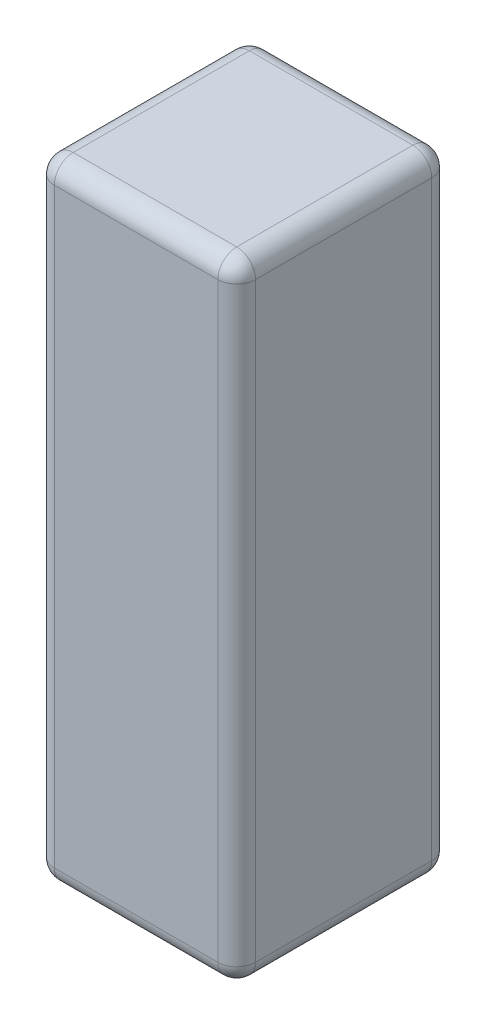
ISO-10303-21;
HEADER;
FILE_DESCRIPTION(('STEP AP214'),'2;1');
FILE_NAME('part.step','',(''),(''),'','','');
FILE_SCHEMA(('AUTOMOTIVE_DESIGN { 1 0 10303 214 1 1 1 1 }'));
ENDSEC;
DATA;
#1=APPLICATION_CONTEXT('core data for automotive mechanical design processes');
#2=APPLICATION_PROTOCOL_DEFINITION('international standard','automotive_design',2000,#1);
#3=PRODUCT_CONTEXT('',#1,'mechanical');
#4=PRODUCT('Part','Part','',(#3));
#5=PRODUCT_RELATED_PRODUCT_CATEGORY('part','',(#4));
#6=PRODUCT_DEFINITION_FORMATION('','',#4);
#7=PRODUCT_DEFINITION_CONTEXT('part definition',#1,'design');
#8=PRODUCT_DEFINITION('design','',#6,#7);
#9=PRODUCT_DEFINITION_SHAPE('','',#8);
#10=(LENGTH_UNIT() NAMED_UNIT(*) SI_UNIT(.MILLI.,.METRE.));
#11=(NAMED_UNIT(*) PLANE_ANGLE_UNIT() SI_UNIT($,.RADIAN.));
#12=(NAMED_UNIT(*) SI_UNIT($,.STERADIAN.) SOLID_ANGLE_UNIT());
#13=UNCERTAINTY_MEASURE_WITH_UNIT(LENGTH_MEASURE(1.E-05),#10,'distance_accuracy_value','');
#14=(GEOMETRIC_REPRESENTATION_CONTEXT(3) GLOBAL_UNCERTAINTY_ASSIGNED_CONTEXT((#13)) GLOBAL_UNIT_ASSIGNED_CONTEXT((#10,
#11,#12)) REPRESENTATION_CONTEXT('',''));
#15=CARTESIAN_POINT('',(0.,0.,0.));
#16=DIRECTION('',(0.,0.,1.));
#17=DIRECTION('',(1.,0.,0.));
#18=AXIS2_PLACEMENT_3D('',#15,#16,#17);
#19=CARTESIAN_POINT('',(30.3060427220879,2.65057988159413,34.));
#20=DIRECTION('',(1.,0.,0.));
#21=DIRECTION('',(0.,1.,0.));
#22=AXIS2_PLACEMENT_3D('',#19,#20,#21);
#23=PLANE('',#22);
#24=DIRECTION('',(0.,-1.,0.));
#25=VECTOR('',#24,1.);
#26=CARTESIAN_POINT('',(30.3060427220879,2.65057988159413,31.));
#27=LINE('',#26,#25);
#28=CARTESIAN_POINT('',(30.3060427220879,-94.3494201184059,31.));
#29=VERTEX_POINT('',#28);
#30=CARTESIAN_POINT('',(30.3060427220879,-0.349420118405869,31.));
#31=VERTEX_POINT('',#30);
#32=EDGE_CURVE('E174',#29,#31,#27,.F.);
#33=ORIENTED_EDGE('',*,*,#32,.T.);
#34=DIRECTION('',(0.,0.,-1.));
#35=VECTOR('',#34,1.);
#36=CARTESIAN_POINT('',(30.3060427220879,-0.349420118405869,34.));
#37=LINE('',#36,#35);
#38=CARTESIAN_POINT('',(30.3060427220879,-0.349420118405869,3.));
#39=VERTEX_POINT('',#38);
#40=EDGE_CURVE('E179',#31,#39,#37,.T.);
#41=ORIENTED_EDGE('',*,*,#40,.T.);
#42=DIRECTION('',(0.,-1.,0.));
#43=VECTOR('',#42,1.);
#44=CARTESIAN_POINT('',(30.3060427220879,2.65057988159413,3.));
#45=LINE('',#44,#43);
#46=CARTESIAN_POINT('',(30.3060427220879,-94.3494201184059,3.));
#47=VERTEX_POINT('',#46);
#48=EDGE_CURVE('E176',#39,#47,#45,.T.);
#49=ORIENTED_EDGE('',*,*,#48,.T.);
#50=DIRECTION('',(0.,0.,-1.));
#51=VECTOR('',#50,1.);
#52=CARTESIAN_POINT('',(30.3060427220879,-94.3494201184059,34.));
#53=LINE('',#52,#51);
#54=EDGE_CURVE('E172',#47,#29,#53,.F.);
#55=ORIENTED_EDGE('',*,*,#54,.T.);
#56=EDGE_LOOP('',(#33,#41,#49,#55));
#57=FACE_BOUND('',#56,.T.);
#58=ADVANCED_FACE('F32',(#57),#23,.F.);
#59=CARTESIAN_POINT('',(30.3060427220879,-97.3494201184059,34.));
#60=DIRECTION('',(0.,1.,0.));
#61=DIRECTION('',(0.,0.,1.));
#62=AXIS2_PLACEMENT_3D('',#59,#60,#61);
#63=PLANE('',#62);
#64=DIRECTION('',(1.,0.,0.));
#65=VECTOR('',#64,1.);
#66=CARTESIAN_POINT('',(30.3060427220879,-97.3494201184059,31.));
#67=LINE('',#66,#65);
#68=CARTESIAN_POINT('',(59.3060427220879,-97.3494201184059,31.));
#69=VERTEX_POINT('',#68);
#70=CARTESIAN_POINT('',(33.3060427220879,-97.3494201184059,31.));
#71=VERTEX_POINT('',#70);
#72=EDGE_CURVE('E41',#69,#71,#67,.F.);
#73=ORIENTED_EDGE('',*,*,#72,.T.);
#74=DIRECTION('',(0.,0.,-1.));
#75=VECTOR('',#74,1.);
#76=CARTESIAN_POINT('',(33.3060427220879,-97.3494201184059,34.));
#77=LINE('',#76,#75);
#78=CARTESIAN_POINT('',(33.3060427220879,-97.3494201184059,3.));
#79=VERTEX_POINT('',#78);
#80=EDGE_CURVE('E11',#71,#79,#77,.T.);
#81=ORIENTED_EDGE('',*,*,#80,.T.);
#82=DIRECTION('',(1.,0.,0.));
#83=VECTOR('',#82,1.);
#84=CARTESIAN_POINT('',(30.3060427220879,-97.3494201184059,3.));
#85=LINE('',#84,#83);
#86=CARTESIAN_POINT('',(59.3060427220879,-97.3494201184059,3.));
#87=VERTEX_POINT('',#86);
#88=EDGE_CURVE('E197',#79,#87,#85,.T.);
#89=ORIENTED_EDGE('',*,*,#88,.T.);
#90=DIRECTION('',(0.,0.,-1.));
#91=VECTOR('',#90,1.);
#92=CARTESIAN_POINT('',(59.3060427220879,-97.3494201184059,34.));
#93=LINE('',#92,#91);
#94=EDGE_CURVE('E52',#87,#69,#93,.F.);
#95=ORIENTED_EDGE('',*,*,#94,.T.);
#96=EDGE_LOOP('',(#73,#81,#89,#95));
#97=FACE_BOUND('',#96,.T.);
#98=ADVANCED_FACE('F306',(#97),#63,.F.);
#99=CARTESIAN_POINT('',(62.3060427220879,2.65057988159413,34.));
#100=DIRECTION('',(-1.,0.,0.));
#101=DIRECTION('',(0.,-1.,0.));
#102=AXIS2_PLACEMENT_3D('',#99,#100,#101);
#103=PLANE('',#102);
#104=DIRECTION('',(0.,1.,0.));
#105=VECTOR('',#104,1.);
#106=CARTESIAN_POINT('',(62.3060427220879,2.65057988159413,3.));
#107=LINE('',#106,#105);
#108=CARTESIAN_POINT('',(62.3060427220879,-94.3494201184059,3.));
#109=VERTEX_POINT('',#108);
#110=CARTESIAN_POINT('',(62.3060427220879,-0.349420118405868,3.));
#111=VERTEX_POINT('',#110);
#112=EDGE_CURVE('E131',#109,#111,#107,.T.);
#113=ORIENTED_EDGE('',*,*,#112,.T.);
#114=DIRECTION('',(0.,0.,-1.));
#115=VECTOR('',#114,1.);
#116=CARTESIAN_POINT('',(62.3060427220879,-0.349420118405868,34.));
#117=LINE('',#116,#115);
#118=CARTESIAN_POINT('',(62.3060427220879,-0.349420118405868,31.));
#119=VERTEX_POINT('',#118);
#120=EDGE_CURVE('E127',#111,#119,#117,.F.);
#121=ORIENTED_EDGE('',*,*,#120,.T.);
#122=DIRECTION('',(0.,1.,0.));
#123=VECTOR('',#122,1.);
#124=CARTESIAN_POINT('',(62.3060427220879,-97.3494201184059,31.));
#125=LINE('',#124,#123);
#126=CARTESIAN_POINT('',(62.3060427220879,-94.3494201184059,31.));
#127=VERTEX_POINT('',#126);
#128=EDGE_CURVE('E119',#119,#127,#125,.F.);
#129=ORIENTED_EDGE('',*,*,#128,.T.);
#130=DIRECTION('',(0.,0.,-1.));
#131=VECTOR('',#130,1.);
#132=CARTESIAN_POINT('',(62.3060427220879,-94.3494201184059,34.));
#133=LINE('',#132,#131);
#134=EDGE_CURVE('E124',#127,#109,#133,.T.);
#135=ORIENTED_EDGE('',*,*,#134,.T.);
#136=EDGE_LOOP('',(#113,#121,#129,#135));
#137=FACE_BOUND('',#136,.T.);
#138=ADVANCED_FACE('F122',(#137),#103,.F.);
#139=CARTESIAN_POINT('',(30.3060427220879,2.65057988159413,34.));
#140=DIRECTION('',(0.,-1.,0.));
#141=DIRECTION('',(0.,0.,-1.));
#142=AXIS2_PLACEMENT_3D('',#139,#140,#141);
#143=PLANE('',#142);
#144=DIRECTION('',(-1.,0.,0.));
#145=VECTOR('',#144,1.);
#146=CARTESIAN_POINT('',(62.3060427220879,2.65057988159413,31.));
#147=LINE('',#146,#145);
#148=CARTESIAN_POINT('',(33.3060427220879,2.65057988159413,31.));
#149=VERTEX_POINT('',#148);
#150=CARTESIAN_POINT('',(59.3060427220879,2.65057988159413,31.));
#151=VERTEX_POINT('',#150);
#152=EDGE_CURVE('E192',#149,#151,#147,.F.);
#153=ORIENTED_EDGE('',*,*,#152,.T.);
#154=DIRECTION('',(0.,0.,-1.));
#155=VECTOR('',#154,1.);
#156=CARTESIAN_POINT('',(59.3060427220879,2.65057988159413,34.));
#157=LINE('',#156,#155);
#158=CARTESIAN_POINT('',(59.3060427220879,2.65057988159413,3.));
#159=VERTEX_POINT('',#158);
#160=EDGE_CURVE('E194',#151,#159,#157,.T.);
#161=ORIENTED_EDGE('',*,*,#160,.T.);
#162=DIRECTION('',(-1.,0.,0.));
#163=VECTOR('',#162,1.);
#164=CARTESIAN_POINT('',(30.3060427220879,2.65057988159413,3.));
#165=LINE('',#164,#163);
#166=CARTESIAN_POINT('',(33.3060427220879,2.65057988159413,3.));
#167=VERTEX_POINT('',#166);
#168=EDGE_CURVE('E188',#159,#167,#165,.T.);
#169=ORIENTED_EDGE('',*,*,#168,.T.);
#170=DIRECTION('',(0.,0.,-1.));
#171=VECTOR('',#170,1.);
#172=CARTESIAN_POINT('',(33.3060427220879,2.65057988159413,34.));
#173=LINE('',#172,#171);
#174=EDGE_CURVE('E190',#167,#149,#173,.F.);
#175=ORIENTED_EDGE('',*,*,#174,.T.);
#176=EDGE_LOOP('',(#153,#161,#169,#175));
#177=FACE_BOUND('',#176,.T.);
#178=ADVANCED_FACE('F263',(#177),#143,.F.);
#179=CARTESIAN_POINT('',(0.,0.,34.));
#180=DIRECTION('',(0.,0.,1.));
#181=DIRECTION('',(1.,0.,0.));
#182=AXIS2_PLACEMENT_3D('',#179,#180,#181);
#183=PLANE('',#182);
#184=DIRECTION('',(0.,1.,0.));
#185=VECTOR('',#184,1.);
#186=CARTESIAN_POINT('',(59.3060427220879,2.65057988159413,34.));
#187=LINE('',#186,#185);
#188=CARTESIAN_POINT('',(59.3060427220879,-94.3494201184059,34.));
#189=VERTEX_POINT('',#188);
#190=CARTESIAN_POINT('',(59.3060427220879,-0.349420118405869,34.));
#191=VERTEX_POINT('',#190);
#192=EDGE_CURVE('E139',#189,#191,#187,.T.);
#193=ORIENTED_EDGE('',*,*,#192,.T.);
#194=DIRECTION('',(-1.,0.,0.));
#195=VECTOR('',#194,1.);
#196=CARTESIAN_POINT('',(30.3060427220879,-0.349420118405869,34.));
#197=LINE('',#196,#195);
#198=CARTESIAN_POINT('',(33.3060427220879,-0.349420118405869,34.));
#199=VERTEX_POINT('',#198);
#200=EDGE_CURVE('E186',#191,#199,#197,.T.);
#201=ORIENTED_EDGE('',*,*,#200,.T.);
#202=DIRECTION('',(0.,-1.,0.));
#203=VECTOR('',#202,1.);
#204=CARTESIAN_POINT('',(33.3060427220879,-97.3494201184059,34.));
#205=LINE('',#204,#203);
#206=CARTESIAN_POINT('',(33.3060427220879,-94.3494201184059,34.));
#207=VERTEX_POINT('',#206);
#208=EDGE_CURVE('E183',#199,#207,#205,.T.);
#209=ORIENTED_EDGE('',*,*,#208,.T.);
#210=DIRECTION('',(1.,0.,0.));
#211=VECTOR('',#210,1.);
#212=CARTESIAN_POINT('',(62.3060427220879,-94.3494201184059,34.));
#213=LINE('',#212,#211);
#214=EDGE_CURVE('E181',#207,#189,#213,.T.);
#215=ORIENTED_EDGE('',*,*,#214,.T.);
#216=EDGE_LOOP('',(#193,#201,#209,#215));
#217=FACE_BOUND('',#216,.T.);
#218=ADVANCED_FACE('F294',(#217),#183,.T.);
#219=CARTESIAN_POINT('',(0.,0.,0.));
#220=DIRECTION('',(0.,0.,1.));
#221=DIRECTION('',(1.,0.,0.));
#222=AXIS2_PLACEMENT_3D('',#219,#220,#221);
#223=PLANE('',#222);
#224=DIRECTION('',(0.,-1.,0.));
#225=VECTOR('',#224,1.);
#226=CARTESIAN_POINT('',(33.3060427220879,0.,0.));
#227=LINE('',#226,#225);
#228=CARTESIAN_POINT('',(33.3060427220879,-94.3494201184059,0.));
#229=VERTEX_POINT('',#228);
#230=CARTESIAN_POINT('',(33.3060427220879,-0.349420118405869,0.));
#231=VERTEX_POINT('',#230);
#232=EDGE_CURVE('E165',#229,#231,#227,.F.);
#233=ORIENTED_EDGE('',*,*,#232,.T.);
#234=DIRECTION('',(-1.,0.,0.));
#235=VECTOR('',#234,1.);
#236=CARTESIAN_POINT('',(0.,-0.349420118405869,0.));
#237=LINE('',#236,#235);
#238=CARTESIAN_POINT('',(59.3060427220879,-0.349420118405869,0.));
#239=VERTEX_POINT('',#238);
#240=EDGE_CURVE('E170',#231,#239,#237,.F.);
#241=ORIENTED_EDGE('',*,*,#240,.T.);
#242=DIRECTION('',(0.,1.,0.));
#243=VECTOR('',#242,1.);
#244=CARTESIAN_POINT('',(59.3060427220879,0.,0.));
#245=LINE('',#244,#243);
#246=CARTESIAN_POINT('',(59.3060427220879,-94.3494201184059,0.));
#247=VERTEX_POINT('',#246);
#248=EDGE_CURVE('E167',#239,#247,#245,.F.);
#249=ORIENTED_EDGE('',*,*,#248,.T.);
#250=DIRECTION('',(1.,0.,0.));
#251=VECTOR('',#250,1.);
#252=CARTESIAN_POINT('',(0.,-94.3494201184059,0.));
#253=LINE('',#252,#251);
#254=EDGE_CURVE('E163',#247,#229,#253,.F.);
#255=ORIENTED_EDGE('',*,*,#254,.T.);
#256=EDGE_LOOP('',(#233,#241,#249,#255));
#257=FACE_BOUND('',#256,.T.);
#258=ADVANCED_FACE('F296',(#257),#223,.F.);
#259=CARTESIAN_POINT('',(33.3060427220879,0.,31.));
#260=DIRECTION('',(0.,1.,0.));
#261=DIRECTION('',(-1.,0.,0.));
#262=AXIS2_PLACEMENT_3D('',#259,#260,#261);
#263=CYLINDRICAL_SURFACE('',#262,3.);
#264=CARTESIAN_POINT('',(33.3060427220879,-94.3494201184059,31.));
#265=DIRECTION('',(0.,-1.,0.));
#266=DIRECTION('',(0.,0.,-1.));
#267=AXIS2_PLACEMENT_3D('',#264,#265,#266);
#268=CIRCLE('',#267,3.);
#269=EDGE_CURVE('E36',#207,#29,#268,.T.);
#270=ORIENTED_EDGE('',*,*,#269,.F.);
#271=ORIENTED_EDGE('',*,*,#208,.F.);
#272=CARTESIAN_POINT('',(33.3060427220879,-0.349420118405869,31.));
#273=DIRECTION('',(0.,1.,0.));
#274=DIRECTION('',(-1.,0.,0.));
#275=AXIS2_PLACEMENT_3D('',#272,#273,#274);
#276=CIRCLE('',#275,3.);
#277=EDGE_CURVE('E159',#31,#199,#276,.T.);
#278=ORIENTED_EDGE('',*,*,#277,.F.);
#279=ORIENTED_EDGE('',*,*,#32,.F.);
#280=EDGE_LOOP('',(#270,#271,#278,#279));
#281=FACE_BOUND('',#280,.T.);
#282=ADVANCED_FACE('F34',(#281),#263,.T.);
#283=CARTESIAN_POINT('',(33.3060427220879,-94.3494201184059,31.));
#284=DIRECTION('',(-1.,0.,0.));
#285=DIRECTION('',(0.,0.,1.));
#286=AXIS2_PLACEMENT_3D('',#283,#284,#285);
#287=SPHERICAL_SURFACE('',#286,3.);
#288=CARTESIAN_POINT('',(33.3060427220879,-94.3494201184059,31.));
#289=DIRECTION('',(-1.,0.,0.));
#290=DIRECTION('',(0.,0.,1.));
#291=AXIS2_PLACEMENT_3D('',#288,#289,#290);
#292=CIRCLE('',#291,3.);
#293=EDGE_CURVE('E242',#207,#71,#292,.F.);
#294=ORIENTED_EDGE('',*,*,#293,.F.);
#295=ORIENTED_EDGE('',*,*,#269,.T.);
#296=CARTESIAN_POINT('',(33.3060427220879,-94.3494201184059,31.));
#297=DIRECTION('',(0.,0.,1.));
#298=DIRECTION('',(1.,0.,0.));
#299=AXIS2_PLACEMENT_3D('',#296,#297,#298);
#300=CIRCLE('',#299,3.);
#301=EDGE_CURVE('E244',#71,#29,#300,.F.);
#302=ORIENTED_EDGE('',*,*,#301,.F.);
#303=EDGE_LOOP('',(#294,#295,#302));
#304=FACE_BOUND('',#303,.T.);
#305=ADVANCED_FACE('F289',(#304),#287,.T.);
#306=CARTESIAN_POINT('',(33.3060427220879,-0.349420118405869,31.));
#307=DIRECTION('',(0.,0.,1.));
#308=DIRECTION('',(1.,0.,0.));
#309=AXIS2_PLACEMENT_3D('',#306,#307,#308);
#310=SPHERICAL_SURFACE('',#309,3.);
#311=CARTESIAN_POINT('',(33.3060427220879,-0.349420118405869,31.));
#312=DIRECTION('',(0.,0.,1.));
#313=DIRECTION('',(1.,0.,0.));
#314=AXIS2_PLACEMENT_3D('',#311,#312,#313);
#315=CIRCLE('',#314,3.);
#316=EDGE_CURVE('E236',#31,#149,#315,.F.);
#317=ORIENTED_EDGE('',*,*,#316,.F.);
#318=ORIENTED_EDGE('',*,*,#277,.T.);
#319=CARTESIAN_POINT('',(33.3060427220879,-0.349420118405869,31.));
#320=DIRECTION('',(-1.,0.,0.));
#321=DIRECTION('',(0.,0.,1.));
#322=AXIS2_PLACEMENT_3D('',#319,#320,#321);
#323=CIRCLE('',#322,3.);
#324=EDGE_CURVE('E239',#149,#199,#323,.F.);
#325=ORIENTED_EDGE('',*,*,#324,.F.);
#326=EDGE_LOOP('',(#317,#318,#325));
#327=FACE_BOUND('',#326,.T.);
#328=ADVANCED_FACE('F251',(#327),#310,.T.);
#329=CARTESIAN_POINT('',(33.3060427220879,-94.3494201184059,34.));
#330=DIRECTION('',(0.,0.,-1.));
#331=DIRECTION('',(-1.,0.,0.));
#332=AXIS2_PLACEMENT_3D('',#329,#330,#331);
#333=CYLINDRICAL_SURFACE('',#332,3.);
#334=ORIENTED_EDGE('',*,*,#301,.T.);
#335=ORIENTED_EDGE('',*,*,#54,.F.);
#336=CARTESIAN_POINT('',(33.3060427220879,-94.3494201184059,3.));
#337=DIRECTION('',(0.,0.,-1.));
#338=DIRECTION('',(-1.,0.,0.));
#339=AXIS2_PLACEMENT_3D('',#336,#337,#338);
#340=CIRCLE('',#339,3.);
#341=EDGE_CURVE('E231',#79,#47,#340,.T.);
#342=ORIENTED_EDGE('',*,*,#341,.F.);
#343=ORIENTED_EDGE('',*,*,#80,.F.);
#344=EDGE_LOOP('',(#334,#335,#342,#343));
#345=FACE_BOUND('',#344,.T.);
#346=ADVANCED_FACE('F283',(#345),#333,.T.);
#347=CARTESIAN_POINT('',(0.,-94.3494201184059,31.));
#348=DIRECTION('',(-1.,0.,0.));
#349=DIRECTION('',(0.,0.,1.));
#350=AXIS2_PLACEMENT_3D('',#347,#348,#349);
#351=CYLINDRICAL_SURFACE('',#350,3.);
#352=ORIENTED_EDGE('',*,*,#293,.T.);
#353=ORIENTED_EDGE('',*,*,#72,.F.);
#354=CARTESIAN_POINT('',(59.3060427220879,-94.3494201184059,31.));
#355=DIRECTION('',(1.,0.,0.));
#356=DIRECTION('',(0.,0.,-1.));
#357=AXIS2_PLACEMENT_3D('',#354,#355,#356);
#358=CIRCLE('',#357,3.);
#359=EDGE_CURVE('E143',#189,#69,#358,.T.);
#360=ORIENTED_EDGE('',*,*,#359,.F.);
#361=ORIENTED_EDGE('',*,*,#214,.F.);
#362=EDGE_LOOP('',(#352,#353,#360,#361));
#363=FACE_BOUND('',#362,.T.);
#364=ADVANCED_FACE('F292',(#363),#351,.T.);
#365=CARTESIAN_POINT('',(59.3060427220879,0.,31.));
#366=DIRECTION('',(0.,-1.,0.));
#367=DIRECTION('',(1.,0.,0.));
#368=AXIS2_PLACEMENT_3D('',#365,#366,#367);
#369=CYLINDRICAL_SURFACE('',#368,3.);
#370=CARTESIAN_POINT('',(59.3060427220879,-0.349420118405869,31.));
#371=DIRECTION('',(0.,1.,0.));
#372=DIRECTION('',(-1.,0.,0.));
#373=AXIS2_PLACEMENT_3D('',#370,#371,#372);
#374=CIRCLE('',#373,3.);
#375=EDGE_CURVE('E144',#191,#119,#374,.T.);
#376=ORIENTED_EDGE('',*,*,#375,.F.);
#377=ORIENTED_EDGE('',*,*,#192,.F.);
#378=CARTESIAN_POINT('',(59.3060427220879,-94.3494201184059,31.));
#379=DIRECTION('',(0.,-1.,0.));
#380=DIRECTION('',(0.,0.,-1.));
#381=AXIS2_PLACEMENT_3D('',#378,#379,#380);
#382=CIRCLE('',#381,3.);
#383=EDGE_CURVE('E135',#127,#189,#382,.T.);
#384=ORIENTED_EDGE('',*,*,#383,.F.);
#385=ORIENTED_EDGE('',*,*,#128,.F.);
#386=EDGE_LOOP('',(#376,#377,#384,#385));
#387=FACE_BOUND('',#386,.T.);
#388=ADVANCED_FACE('F137',(#387),#369,.T.);
#389=CARTESIAN_POINT('',(0.,-0.349420118405869,31.));
#390=DIRECTION('',(1.,0.,0.));
#391=DIRECTION('',(0.,0.,-1.));
#392=AXIS2_PLACEMENT_3D('',#389,#390,#391);
#393=CYLINDRICAL_SURFACE('',#392,3.);
#394=ORIENTED_EDGE('',*,*,#324,.T.);
#395=ORIENTED_EDGE('',*,*,#200,.F.);
#396=CARTESIAN_POINT('',(59.3060427220879,-0.349420118405869,31.));
#397=DIRECTION('',(1.,0.,0.));
#398=DIRECTION('',(0.,0.,-1.));
#399=AXIS2_PLACEMENT_3D('',#396,#397,#398);
#400=CIRCLE('',#399,3.);
#401=EDGE_CURVE('E227',#151,#191,#400,.T.);
#402=ORIENTED_EDGE('',*,*,#401,.F.);
#403=ORIENTED_EDGE('',*,*,#152,.F.);
#404=EDGE_LOOP('',(#394,#395,#402,#403));
#405=FACE_BOUND('',#404,.T.);
#406=ADVANCED_FACE('F259',(#405),#393,.T.);
#407=CARTESIAN_POINT('',(33.3060427220879,-0.349420118405869,34.));
#408=DIRECTION('',(0.,0.,-1.));
#409=DIRECTION('',(-1.,0.,0.));
#410=AXIS2_PLACEMENT_3D('',#407,#408,#409);
#411=CYLINDRICAL_SURFACE('',#410,3.);
#412=ORIENTED_EDGE('',*,*,#316,.T.);
#413=ORIENTED_EDGE('',*,*,#174,.F.);
#414=CARTESIAN_POINT('',(33.3060427220879,-0.349420118405869,3.));
#415=DIRECTION('',(0.,0.,-1.));
#416=DIRECTION('',(-1.,0.,0.));
#417=AXIS2_PLACEMENT_3D('',#414,#415,#416);
#418=CIRCLE('',#417,3.);
#419=EDGE_CURVE('E224',#39,#167,#418,.T.);
#420=ORIENTED_EDGE('',*,*,#419,.F.);
#421=ORIENTED_EDGE('',*,*,#40,.F.);
#422=EDGE_LOOP('',(#412,#413,#420,#421));
#423=FACE_BOUND('',#422,.T.);
#424=ADVANCED_FACE('F269',(#423),#411,.T.);
#425=CARTESIAN_POINT('',(33.3060427220879,2.65057988159413,3.));
#426=DIRECTION('',(0.,-1.,0.));
#427=DIRECTION('',(1.,0.,0.));
#428=AXIS2_PLACEMENT_3D('',#425,#426,#427);
#429=CYLINDRICAL_SURFACE('',#428,3.);
#430=CARTESIAN_POINT('',(33.3060427220879,-94.3494201184059,3.));
#431=DIRECTION('',(0.,-1.,0.));
#432=DIRECTION('',(0.,0.,-1.));
#433=AXIS2_PLACEMENT_3D('',#430,#431,#432);
#434=CIRCLE('',#433,3.);
#435=EDGE_CURVE('E233',#47,#229,#434,.T.);
#436=ORIENTED_EDGE('',*,*,#435,.F.);
#437=ORIENTED_EDGE('',*,*,#48,.F.);
#438=CARTESIAN_POINT('',(33.3060427220879,-0.349420118405869,3.));
#439=DIRECTION('',(0.,1.,0.));
#440=DIRECTION('',(-1.,0.,0.));
#441=AXIS2_PLACEMENT_3D('',#438,#439,#440);
#442=CIRCLE('',#441,3.);
#443=EDGE_CURVE('E221',#231,#39,#442,.T.);
#444=ORIENTED_EDGE('',*,*,#443,.F.);
#445=ORIENTED_EDGE('',*,*,#232,.F.);
#446=EDGE_LOOP('',(#436,#437,#444,#445));
#447=FACE_BOUND('',#446,.T.);
#448=ADVANCED_FACE('F275',(#447),#429,.T.);
#449=CARTESIAN_POINT('',(33.3060427220879,-94.3494201184059,3.));
#450=DIRECTION('',(-1.,0.,0.));
#451=DIRECTION('',(0.,0.,1.));
#452=AXIS2_PLACEMENT_3D('',#449,#450,#451);
#453=SPHERICAL_SURFACE('',#452,3.);
#454=ORIENTED_EDGE('',*,*,#341,.T.);
#455=ORIENTED_EDGE('',*,*,#435,.T.);
#456=CARTESIAN_POINT('',(33.3060427220879,-94.3494201184059,3.));
#457=DIRECTION('',(-1.,0.,0.));
#458=DIRECTION('',(0.,0.,1.));
#459=AXIS2_PLACEMENT_3D('',#456,#457,#458);
#460=CIRCLE('',#459,3.);
#461=EDGE_CURVE('E150',#79,#229,#460,.F.);
#462=ORIENTED_EDGE('',*,*,#461,.F.);
#463=EDGE_LOOP('',(#454,#455,#462));
#464=FACE_BOUND('',#463,.T.);
#465=ADVANCED_FACE('F350',(#464),#453,.T.);
#466=CARTESIAN_POINT('',(59.3060427220879,-94.3494201184059,31.));
#467=DIRECTION('',(0.,0.,1.));
#468=DIRECTION('',(1.,0.,0.));
#469=AXIS2_PLACEMENT_3D('',#466,#467,#468);
#470=SPHERICAL_SURFACE('',#469,3.);
#471=ORIENTED_EDGE('',*,*,#383,.T.);
#472=ORIENTED_EDGE('',*,*,#359,.T.);
#473=CARTESIAN_POINT('',(59.3060427220879,-94.3494201184059,31.));
#474=DIRECTION('',(0.,0.,1.));
#475=DIRECTION('',(1.,0.,0.));
#476=AXIS2_PLACEMENT_3D('',#473,#474,#475);
#477=CIRCLE('',#476,3.);
#478=EDGE_CURVE('E147',#127,#69,#477,.F.);
#479=ORIENTED_EDGE('',*,*,#478,.F.);
#480=EDGE_LOOP('',(#471,#472,#479));
#481=FACE_BOUND('',#480,.T.);
#482=ADVANCED_FACE('F148',(#481),#470,.T.);
#483=CARTESIAN_POINT('',(59.3060427220879,-0.349420118405869,31.));
#484=DIRECTION('',(0.,0.,1.));
#485=DIRECTION('',(1.,0.,0.));
#486=AXIS2_PLACEMENT_3D('',#483,#484,#485);
#487=SPHERICAL_SURFACE('',#486,3.);
#488=ORIENTED_EDGE('',*,*,#401,.T.);
#489=ORIENTED_EDGE('',*,*,#375,.T.);
#490=CARTESIAN_POINT('',(59.3060427220879,-0.349420118405869,31.));
#491=DIRECTION('',(0.,0.,1.));
#492=DIRECTION('',(1.,0.,0.));
#493=AXIS2_PLACEMENT_3D('',#490,#491,#492);
#494=CIRCLE('',#493,3.);
#495=EDGE_CURVE('E151',#151,#119,#494,.F.);
#496=ORIENTED_EDGE('',*,*,#495,.F.);
#497=EDGE_LOOP('',(#488,#489,#496));
#498=FACE_BOUND('',#497,.T.);
#499=ADVANCED_FACE('F343',(#498),#487,.T.);
#500=CARTESIAN_POINT('',(33.3060427220879,-0.349420118405869,3.));
#501=DIRECTION('',(-1.,0.,0.));
#502=DIRECTION('',(0.,0.,1.));
#503=AXIS2_PLACEMENT_3D('',#500,#501,#502);
#504=SPHERICAL_SURFACE('',#503,3.);
#505=ORIENTED_EDGE('',*,*,#443,.T.);
#506=ORIENTED_EDGE('',*,*,#419,.T.);
#507=CARTESIAN_POINT('',(33.3060427220879,-0.349420118405869,3.));
#508=DIRECTION('',(-1.,0.,0.));
#509=DIRECTION('',(0.,0.,1.));
#510=AXIS2_PLACEMENT_3D('',#507,#508,#509);
#511=CIRCLE('',#510,3.);
#512=EDGE_CURVE('E214',#231,#167,#511,.F.);
#513=ORIENTED_EDGE('',*,*,#512,.F.);
#514=EDGE_LOOP('',(#505,#506,#513));
#515=FACE_BOUND('',#514,.T.);
#516=ADVANCED_FACE('F339',(#515),#504,.T.);
#517=CARTESIAN_POINT('',(30.3060427220879,-94.3494201184059,3.));
#518=DIRECTION('',(1.,0.,0.));
#519=DIRECTION('',(0.,0.,-1.));
#520=AXIS2_PLACEMENT_3D('',#517,#518,#519);
#521=CYLINDRICAL_SURFACE('',#520,3.);
#522=ORIENTED_EDGE('',*,*,#461,.T.);
#523=ORIENTED_EDGE('',*,*,#254,.F.);
#524=CARTESIAN_POINT('',(59.3060427220879,-94.3494201184059,3.));
#525=DIRECTION('',(1.,0.,0.));
#526=DIRECTION('',(0.,0.,-1.));
#527=AXIS2_PLACEMENT_3D('',#524,#525,#526);
#528=CIRCLE('',#527,3.);
#529=EDGE_CURVE('E211',#87,#247,#528,.T.);
#530=ORIENTED_EDGE('',*,*,#529,.F.);
#531=ORIENTED_EDGE('',*,*,#88,.F.);
#532=EDGE_LOOP('',(#522,#523,#530,#531));
#533=FACE_BOUND('',#532,.T.);
#534=ADVANCED_FACE('F336',(#533),#521,.T.);
#535=CARTESIAN_POINT('',(59.3060427220879,-94.3494201184059,34.));
#536=DIRECTION('',(0.,0.,-1.));
#537=DIRECTION('',(-1.,0.,0.));
#538=AXIS2_PLACEMENT_3D('',#535,#536,#537);
#539=CYLINDRICAL_SURFACE('',#538,3.);
#540=ORIENTED_EDGE('',*,*,#478,.T.);
#541=ORIENTED_EDGE('',*,*,#94,.F.);
#542=CARTESIAN_POINT('',(59.3060427220879,-94.3494201184059,3.));
#543=DIRECTION('',(0.,0.,-1.));
#544=DIRECTION('',(-1.,0.,0.));
#545=AXIS2_PLACEMENT_3D('',#542,#543,#544);
#546=CIRCLE('',#545,3.);
#547=EDGE_CURVE('E155',#109,#87,#546,.T.);
#548=ORIENTED_EDGE('',*,*,#547,.F.);
#549=ORIENTED_EDGE('',*,*,#134,.F.);
#550=EDGE_LOOP('',(#540,#541,#548,#549));
#551=FACE_BOUND('',#550,.T.);
#552=ADVANCED_FACE('F153',(#551),#539,.T.);
#553=CARTESIAN_POINT('',(59.3060427220879,-0.349420118405869,34.));
#554=DIRECTION('',(0.,0.,-1.));
#555=DIRECTION('',(-1.,0.,0.));
#556=AXIS2_PLACEMENT_3D('',#553,#554,#555);
#557=CYLINDRICAL_SURFACE('',#556,3.);
#558=ORIENTED_EDGE('',*,*,#495,.T.);
#559=ORIENTED_EDGE('',*,*,#120,.F.);
#560=CARTESIAN_POINT('',(59.3060427220879,-0.349420118405869,3.));
#561=DIRECTION('',(0.,0.,-1.));
#562=DIRECTION('',(-1.,0.,0.));
#563=AXIS2_PLACEMENT_3D('',#560,#561,#562);
#564=CIRCLE('',#563,3.);
#565=EDGE_CURVE('E207',#159,#111,#564,.T.);
#566=ORIENTED_EDGE('',*,*,#565,.F.);
#567=ORIENTED_EDGE('',*,*,#160,.F.);
#568=EDGE_LOOP('',(#558,#559,#566,#567));
#569=FACE_BOUND('',#568,.T.);
#570=ADVANCED_FACE('F329',(#569),#557,.T.);
#571=CARTESIAN_POINT('',(30.3060427220879,-0.349420118405869,3.));
#572=DIRECTION('',(-1.,0.,0.));
#573=DIRECTION('',(0.,0.,1.));
#574=AXIS2_PLACEMENT_3D('',#571,#572,#573);
#575=CYLINDRICAL_SURFACE('',#574,3.);
#576=ORIENTED_EDGE('',*,*,#512,.T.);
#577=ORIENTED_EDGE('',*,*,#168,.F.);
#578=CARTESIAN_POINT('',(59.3060427220879,-0.349420118405869,3.));
#579=DIRECTION('',(1.,0.,0.));
#580=DIRECTION('',(0.,0.,-1.));
#581=AXIS2_PLACEMENT_3D('',#578,#579,#580);
#582=CIRCLE('',#581,3.);
#583=EDGE_CURVE('E205',#239,#159,#582,.T.);
#584=ORIENTED_EDGE('',*,*,#583,.F.);
#585=ORIENTED_EDGE('',*,*,#240,.F.);
#586=EDGE_LOOP('',(#576,#577,#584,#585));
#587=FACE_BOUND('',#586,.T.);
#588=ADVANCED_FACE('F325',(#587),#575,.T.);
#589=CARTESIAN_POINT('',(59.3060427220879,-94.3494201184059,3.));
#590=DIRECTION('',(0.,-1.,0.));
#591=DIRECTION('',(0.,0.,-1.));
#592=AXIS2_PLACEMENT_3D('',#589,#590,#591);
#593=SPHERICAL_SURFACE('',#592,3.);
#594=ORIENTED_EDGE('',*,*,#547,.T.);
#595=ORIENTED_EDGE('',*,*,#529,.T.);
#596=CARTESIAN_POINT('',(59.3060427220879,-94.3494201184059,3.));
#597=DIRECTION('',(0.,-1.,0.));
#598=DIRECTION('',(0.,0.,-1.));
#599=AXIS2_PLACEMENT_3D('',#596,#597,#598);
#600=CIRCLE('',#599,3.);
#601=EDGE_CURVE('E203',#109,#247,#600,.F.);
#602=ORIENTED_EDGE('',*,*,#601,.F.);
#603=EDGE_LOOP('',(#594,#595,#602));
#604=FACE_BOUND('',#603,.T.);
#605=ADVANCED_FACE('F321',(#604),#593,.T.);
#606=CARTESIAN_POINT('',(59.3060427220879,-0.349420118405869,3.));
#607=DIRECTION('',(0.,1.,0.));
#608=DIRECTION('',(0.,0.,1.));
#609=AXIS2_PLACEMENT_3D('',#606,#607,#608);
#610=SPHERICAL_SURFACE('',#609,3.);
#611=ORIENTED_EDGE('',*,*,#583,.T.);
#612=ORIENTED_EDGE('',*,*,#565,.T.);
#613=CARTESIAN_POINT('',(59.3060427220879,-0.349420118405869,3.));
#614=DIRECTION('',(0.,1.,0.));
#615=DIRECTION('',(-1.,0.,0.));
#616=AXIS2_PLACEMENT_3D('',#613,#614,#615);
#617=CIRCLE('',#616,3.);
#618=EDGE_CURVE('E201',#239,#111,#617,.F.);
#619=ORIENTED_EDGE('',*,*,#618,.F.);
#620=EDGE_LOOP('',(#611,#612,#619));
#621=FACE_BOUND('',#620,.T.);
#622=ADVANCED_FACE('F317',(#621),#610,.T.);
#623=CARTESIAN_POINT('',(59.3060427220879,2.65057988159413,3.));
#624=DIRECTION('',(0.,1.,0.));
#625=DIRECTION('',(-1.,0.,0.));
#626=AXIS2_PLACEMENT_3D('',#623,#624,#625);
#627=CYLINDRICAL_SURFACE('',#626,3.);
#628=ORIENTED_EDGE('',*,*,#601,.T.);
#629=ORIENTED_EDGE('',*,*,#248,.F.);
#630=ORIENTED_EDGE('',*,*,#618,.T.);
#631=ORIENTED_EDGE('',*,*,#112,.F.);
#632=EDGE_LOOP('',(#628,#629,#630,#631));
#633=FACE_BOUND('',#632,.T.);
#634=ADVANCED_FACE('F314',(#633),#627,.T.);
#635=CLOSED_SHELL('',(#58,#98,#138,#178,#218,#258,#282,#305,#328,#346,#364,#388,#406,#424,#448,
#465,#482,#499,#516,#534,#552,#570,#588,#605,#622,#634));
#636=MANIFOLD_SOLID_BREP('B2',#635);
#637=ADVANCED_BREP_SHAPE_REPRESENTATION('',(#18,#636),#14);
#638=SHAPE_DEFINITION_REPRESENTATION(#9,#637);
ENDSEC;
END-ISO-10303-21;
